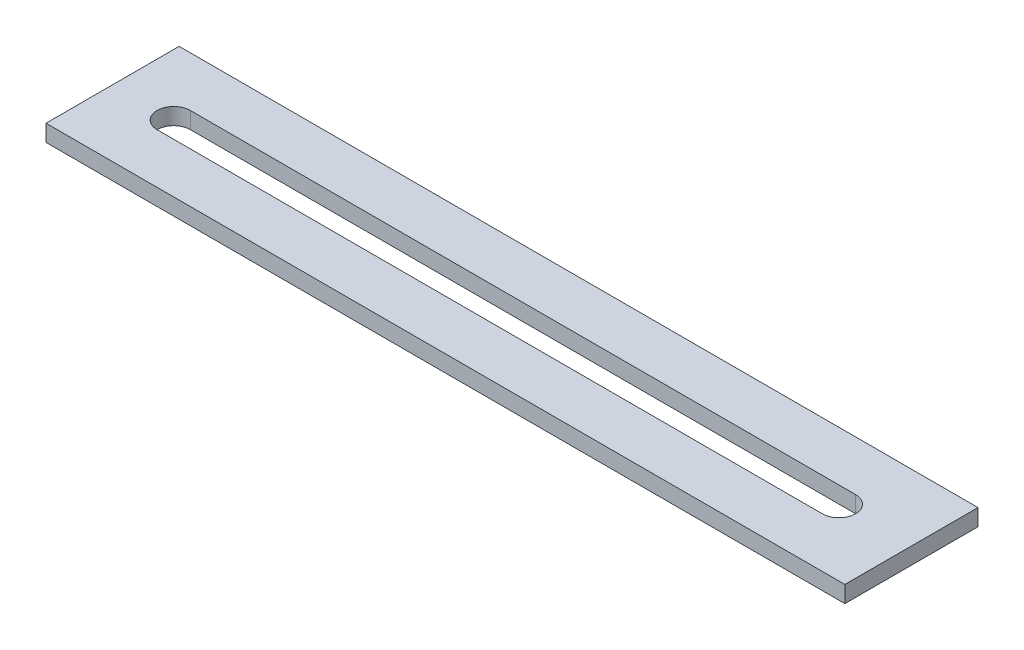
ISO-10303-21;
HEADER;
FILE_DESCRIPTION(('STEP AP214'),'2;1');
FILE_NAME('part.step','',(''),(''),'','','');
FILE_SCHEMA(('AUTOMOTIVE_DESIGN { 1 0 10303 214 1 1 1 1 }'));
ENDSEC;
DATA;
#1=APPLICATION_CONTEXT('core data for automotive mechanical design processes');
#2=APPLICATION_PROTOCOL_DEFINITION('international standard','automotive_design',2000,#1);
#3=PRODUCT_CONTEXT('',#1,'mechanical');
#4=PRODUCT('Part','Part','',(#3));
#5=PRODUCT_RELATED_PRODUCT_CATEGORY('part','',(#4));
#6=PRODUCT_DEFINITION_FORMATION('','',#4);
#7=PRODUCT_DEFINITION_CONTEXT('part definition',#1,'design');
#8=PRODUCT_DEFINITION('design','',#6,#7);
#9=PRODUCT_DEFINITION_SHAPE('','',#8);
#10=(LENGTH_UNIT() NAMED_UNIT(*) SI_UNIT(.MILLI.,.METRE.));
#11=(NAMED_UNIT(*) PLANE_ANGLE_UNIT() SI_UNIT($,.RADIAN.));
#12=(NAMED_UNIT(*) SI_UNIT($,.STERADIAN.) SOLID_ANGLE_UNIT());
#13=UNCERTAINTY_MEASURE_WITH_UNIT(LENGTH_MEASURE(1.E-05),#10,'distance_accuracy_value','');
#14=(GEOMETRIC_REPRESENTATION_CONTEXT(3) GLOBAL_UNCERTAINTY_ASSIGNED_CONTEXT((#13)) GLOBAL_UNIT_ASSIGNED_CONTEXT((#10,
#11,#12)) REPRESENTATION_CONTEXT('',''));
#15=CARTESIAN_POINT('',(0.,0.,0.));
#16=DIRECTION('',(0.,0.,1.));
#17=DIRECTION('',(1.,0.,0.));
#18=AXIS2_PLACEMENT_3D('',#15,#16,#17);
#19=CARTESIAN_POINT('',(0.,3.175,0.));
#20=DIRECTION('',(0.,-1.,0.));
#21=DIRECTION('',(0.,0.,-1.));
#22=AXIS2_PLACEMENT_3D('',#19,#20,#21);
#23=PLANE('',#22);
#24=DIRECTION('',(0.,0.,1.));
#25=VECTOR('',#24,1.);
#26=CARTESIAN_POINT('',(0.,3.175,0.));
#27=LINE('',#26,#25);
#28=CARTESIAN_POINT('',(0.,3.175,-25.4));
#29=VERTEX_POINT('',#28);
#30=CARTESIAN_POINT('',(0.,3.175,0.));
#31=VERTEX_POINT('',#30);
#32=EDGE_CURVE('E134',#29,#31,#27,.T.);
#33=ORIENTED_EDGE('',*,*,#32,.T.);
#34=DIRECTION('',(1.,0.,0.));
#35=VECTOR('',#34,1.);
#36=CARTESIAN_POINT('',(0.,3.175,0.));
#37=LINE('',#36,#35);
#38=CARTESIAN_POINT('',(152.4,3.175,0.));
#39=VERTEX_POINT('',#38);
#40=EDGE_CURVE('E137',#31,#39,#37,.T.);
#41=ORIENTED_EDGE('',*,*,#40,.T.);
#42=DIRECTION('',(0.,0.,-1.));
#43=VECTOR('',#42,1.);
#44=CARTESIAN_POINT('',(152.4,3.175,0.));
#45=LINE('',#44,#43);
#46=CARTESIAN_POINT('',(152.4,3.175,-25.4));
#47=VERTEX_POINT('',#46);
#48=EDGE_CURVE('E140',#39,#47,#45,.T.);
#49=ORIENTED_EDGE('',*,*,#48,.T.);
#50=DIRECTION('',(-1.,0.,0.));
#51=VECTOR('',#50,1.);
#52=CARTESIAN_POINT('',(0.,3.175,-25.4));
#53=LINE('',#52,#51);
#54=EDGE_CURVE('E142',#47,#29,#53,.T.);
#55=ORIENTED_EDGE('',*,*,#54,.T.);
#56=EDGE_LOOP('',(#33,#41,#49,#55));
#57=FACE_BOUND('',#56,.T.);
#58=CARTESIAN_POINT('',(11.6633160622096,3.175,-12.7));
#59=DIRECTION('',(0.,1.,0.));
#60=DIRECTION('',(0.,0.,1.));
#61=AXIS2_PLACEMENT_3D('',#58,#59,#60);
#62=CIRCLE('',#61,3.175);
#63=CARTESIAN_POINT('',(11.6633160622096,3.175,-15.875));
#64=VERTEX_POINT('',#63);
#65=CARTESIAN_POINT('',(11.6633160622096,3.175,-9.525));
#66=VERTEX_POINT('',#65);
#67=EDGE_CURVE('E98',#64,#66,#62,.T.);
#68=ORIENTED_EDGE('',*,*,#67,.F.);
#69=DIRECTION('',(-1.,0.,0.));
#70=VECTOR('',#69,1.);
#71=CARTESIAN_POINT('',(11.6633160622096,3.175,-15.875));
#72=LINE('',#71,#70);
#73=CARTESIAN_POINT('',(138.576758833543,3.175,-15.875));
#74=VERTEX_POINT('',#73);
#75=EDGE_CURVE('E120',#74,#64,#72,.T.);
#76=ORIENTED_EDGE('',*,*,#75,.F.);
#77=CARTESIAN_POINT('',(138.576758833543,3.175,-12.7));
#78=DIRECTION('',(0.,1.,0.));
#79=DIRECTION('',(0.,0.,1.));
#80=AXIS2_PLACEMENT_3D('',#77,#78,#79);
#81=CIRCLE('',#80,3.175);
#82=CARTESIAN_POINT('',(138.576758833543,3.175,-9.525));
#83=VERTEX_POINT('',#82);
#84=EDGE_CURVE('E118',#83,#74,#81,.T.);
#85=ORIENTED_EDGE('',*,*,#84,.F.);
#86=DIRECTION('',(1.,0.,0.));
#87=VECTOR('',#86,1.);
#88=CARTESIAN_POINT('',(11.6633160622096,3.175,-9.525));
#89=LINE('',#88,#87);
#90=EDGE_CURVE('E106',#66,#83,#89,.T.);
#91=ORIENTED_EDGE('',*,*,#90,.F.);
#92=EDGE_LOOP('',(#68,#76,#85,#91));
#93=FACE_BOUND('',#92,.T.);
#94=ADVANCED_FACE('F33',(#57,#93),#23,.F.);
#95=CARTESIAN_POINT('',(0.,0.,0.));
#96=DIRECTION('',(0.,-1.,0.));
#97=DIRECTION('',(0.,0.,-1.));
#98=AXIS2_PLACEMENT_3D('',#95,#96,#97);
#99=PLANE('',#98);
#100=DIRECTION('',(0.,0.,1.));
#101=VECTOR('',#100,1.);
#102=CARTESIAN_POINT('',(0.,0.,0.));
#103=LINE('',#102,#101);
#104=CARTESIAN_POINT('',(0.,0.,-25.4));
#105=VERTEX_POINT('',#104);
#106=CARTESIAN_POINT('',(0.,0.,0.));
#107=VERTEX_POINT('',#106);
#108=EDGE_CURVE('E114',#105,#107,#103,.T.);
#109=ORIENTED_EDGE('',*,*,#108,.F.);
#110=DIRECTION('',(-1.,0.,0.));
#111=VECTOR('',#110,1.);
#112=CARTESIAN_POINT('',(0.,0.,-25.4));
#113=LINE('',#112,#111);
#114=CARTESIAN_POINT('',(152.4,0.,-25.4));
#115=VERTEX_POINT('',#114);
#116=EDGE_CURVE('E138',#115,#105,#113,.T.);
#117=ORIENTED_EDGE('',*,*,#116,.F.);
#118=DIRECTION('',(0.,0.,-1.));
#119=VECTOR('',#118,1.);
#120=CARTESIAN_POINT('',(152.4,0.,0.));
#121=LINE('',#120,#119);
#122=CARTESIAN_POINT('',(152.4,0.,0.));
#123=VERTEX_POINT('',#122);
#124=EDGE_CURVE('E149',#123,#115,#121,.T.);
#125=ORIENTED_EDGE('',*,*,#124,.F.);
#126=DIRECTION('',(1.,0.,0.));
#127=VECTOR('',#126,1.);
#128=CARTESIAN_POINT('',(0.,0.,0.));
#129=LINE('',#128,#127);
#130=EDGE_CURVE('E147',#107,#123,#129,.T.);
#131=ORIENTED_EDGE('',*,*,#130,.F.);
#132=EDGE_LOOP('',(#109,#117,#125,#131));
#133=FACE_BOUND('',#132,.T.);
#134=DIRECTION('',(-1.,0.,0.));
#135=VECTOR('',#134,1.);
#136=CARTESIAN_POINT('',(11.6633160622096,0.,-15.875));
#137=LINE('',#136,#135);
#138=CARTESIAN_POINT('',(138.576758833543,0.,-15.875));
#139=VERTEX_POINT('',#138);
#140=CARTESIAN_POINT('',(11.6633160622096,0.,-15.875));
#141=VERTEX_POINT('',#140);
#142=EDGE_CURVE('E107',#139,#141,#137,.T.);
#143=ORIENTED_EDGE('',*,*,#142,.T.);
#144=CARTESIAN_POINT('',(11.6633160622096,0.,-12.7));
#145=DIRECTION('',(0.,1.,0.));
#146=DIRECTION('',(0.,0.,1.));
#147=AXIS2_PLACEMENT_3D('',#144,#145,#146);
#148=CIRCLE('',#147,3.175);
#149=CARTESIAN_POINT('',(11.6633160622096,0.,-9.525));
#150=VERTEX_POINT('',#149);
#151=EDGE_CURVE('E56',#141,#150,#148,.T.);
#152=ORIENTED_EDGE('',*,*,#151,.T.);
#153=DIRECTION('',(1.,0.,0.));
#154=VECTOR('',#153,1.);
#155=CARTESIAN_POINT('',(11.6633160622096,0.,-9.525));
#156=LINE('',#155,#154);
#157=CARTESIAN_POINT('',(138.576758833543,0.,-9.525));
#158=VERTEX_POINT('',#157);
#159=EDGE_CURVE('E113',#150,#158,#156,.T.);
#160=ORIENTED_EDGE('',*,*,#159,.T.);
#161=CARTESIAN_POINT('',(138.576758833543,0.,-12.7));
#162=DIRECTION('',(0.,1.,0.));
#163=DIRECTION('',(0.,0.,1.));
#164=AXIS2_PLACEMENT_3D('',#161,#162,#163);
#165=CIRCLE('',#164,3.175);
#166=EDGE_CURVE('E126',#158,#139,#165,.T.);
#167=ORIENTED_EDGE('',*,*,#166,.T.);
#168=EDGE_LOOP('',(#143,#152,#160,#167));
#169=FACE_BOUND('',#168,.T.);
#170=ADVANCED_FACE('F167',(#133,#169),#99,.T.);
#171=CARTESIAN_POINT('',(0.,3.175,0.));
#172=DIRECTION('',(1.,0.,0.));
#173=DIRECTION('',(0.,0.,-1.));
#174=AXIS2_PLACEMENT_3D('',#171,#172,#173);
#175=PLANE('',#174);
#176=ORIENTED_EDGE('',*,*,#108,.T.);
#177=DIRECTION('',(0.,-1.,0.));
#178=VECTOR('',#177,1.);
#179=CARTESIAN_POINT('',(0.,3.175,0.));
#180=LINE('',#179,#178);
#181=EDGE_CURVE('E11',#31,#107,#180,.T.);
#182=ORIENTED_EDGE('',*,*,#181,.F.);
#183=ORIENTED_EDGE('',*,*,#32,.F.);
#184=DIRECTION('',(0.,-1.,0.));
#185=VECTOR('',#184,1.);
#186=CARTESIAN_POINT('',(0.,3.175,-25.4));
#187=LINE('',#186,#185);
#188=EDGE_CURVE('E144',#29,#105,#187,.T.);
#189=ORIENTED_EDGE('',*,*,#188,.T.);
#190=EDGE_LOOP('',(#176,#182,#183,#189));
#191=FACE_BOUND('',#190,.T.);
#192=ADVANCED_FACE('F35',(#191),#175,.F.);
#193=CARTESIAN_POINT('',(0.,3.175,0.));
#194=DIRECTION('',(0.,0.,-1.));
#195=DIRECTION('',(-1.,0.,0.));
#196=AXIS2_PLACEMENT_3D('',#193,#194,#195);
#197=PLANE('',#196);
#198=ORIENTED_EDGE('',*,*,#130,.T.);
#199=DIRECTION('',(0.,-1.,0.));
#200=VECTOR('',#199,1.);
#201=CARTESIAN_POINT('',(152.4,3.175,0.));
#202=LINE('',#201,#200);
#203=EDGE_CURVE('E41',#39,#123,#202,.T.);
#204=ORIENTED_EDGE('',*,*,#203,.F.);
#205=ORIENTED_EDGE('',*,*,#40,.F.);
#206=ORIENTED_EDGE('',*,*,#181,.T.);
#207=EDGE_LOOP('',(#198,#204,#205,#206));
#208=FACE_BOUND('',#207,.T.);
#209=ADVANCED_FACE('F177',(#208),#197,.F.);
#210=CARTESIAN_POINT('',(152.4,3.175,0.));
#211=DIRECTION('',(-1.,0.,0.));
#212=DIRECTION('',(0.,0.,1.));
#213=AXIS2_PLACEMENT_3D('',#210,#211,#212);
#214=PLANE('',#213);
#215=ORIENTED_EDGE('',*,*,#124,.T.);
#216=DIRECTION('',(0.,-1.,0.));
#217=VECTOR('',#216,1.);
#218=CARTESIAN_POINT('',(152.4,3.175,-25.4));
#219=LINE('',#218,#217);
#220=EDGE_CURVE('E154',#47,#115,#219,.T.);
#221=ORIENTED_EDGE('',*,*,#220,.F.);
#222=ORIENTED_EDGE('',*,*,#48,.F.);
#223=ORIENTED_EDGE('',*,*,#203,.T.);
#224=EDGE_LOOP('',(#215,#221,#222,#223));
#225=FACE_BOUND('',#224,.T.);
#226=ADVANCED_FACE('F161',(#225),#214,.F.);
#227=CARTESIAN_POINT('',(0.,3.175,-25.4));
#228=DIRECTION('',(0.,0.,1.));
#229=DIRECTION('',(1.,0.,0.));
#230=AXIS2_PLACEMENT_3D('',#227,#228,#229);
#231=PLANE('',#230);
#232=ORIENTED_EDGE('',*,*,#116,.T.);
#233=ORIENTED_EDGE('',*,*,#188,.F.);
#234=ORIENTED_EDGE('',*,*,#54,.F.);
#235=ORIENTED_EDGE('',*,*,#220,.T.);
#236=EDGE_LOOP('',(#232,#233,#234,#235));
#237=FACE_BOUND('',#236,.T.);
#238=ADVANCED_FACE('F171',(#237),#231,.F.);
#239=CARTESIAN_POINT('',(11.6633160622096,3.175,-12.7));
#240=DIRECTION('',(0.,-1.,0.));
#241=DIRECTION('',(0.,0.,-1.));
#242=AXIS2_PLACEMENT_3D('',#239,#240,#241);
#243=CYLINDRICAL_SURFACE('',#242,3.175);
#244=ORIENTED_EDGE('',*,*,#151,.F.);
#245=DIRECTION('',(0.,-1.,0.));
#246=VECTOR('',#245,1.);
#247=CARTESIAN_POINT('',(11.6633160622096,3.175,-15.875));
#248=LINE('',#247,#246);
#249=EDGE_CURVE('E102',#64,#141,#248,.T.);
#250=ORIENTED_EDGE('',*,*,#249,.F.);
#251=ORIENTED_EDGE('',*,*,#67,.T.);
#252=DIRECTION('',(0.,-1.,0.));
#253=VECTOR('',#252,1.);
#254=CARTESIAN_POINT('',(11.6633160622096,3.175,-9.525));
#255=LINE('',#254,#253);
#256=EDGE_CURVE('E101',#66,#150,#255,.T.);
#257=ORIENTED_EDGE('',*,*,#256,.T.);
#258=EDGE_LOOP('',(#244,#250,#251,#257));
#259=FACE_BOUND('',#258,.T.);
#260=ADVANCED_FACE('F100',(#259),#243,.F.);
#261=CARTESIAN_POINT('',(11.6633160622096,3.175,-9.525));
#262=DIRECTION('',(0.,0.,-1.));
#263=DIRECTION('',(-1.,0.,0.));
#264=AXIS2_PLACEMENT_3D('',#261,#262,#263);
#265=PLANE('',#264);
#266=ORIENTED_EDGE('',*,*,#159,.F.);
#267=ORIENTED_EDGE('',*,*,#256,.F.);
#268=ORIENTED_EDGE('',*,*,#90,.T.);
#269=DIRECTION('',(0.,-1.,0.));
#270=VECTOR('',#269,1.);
#271=CARTESIAN_POINT('',(138.576758833543,3.175,-9.525));
#272=LINE('',#271,#270);
#273=EDGE_CURVE('E115',#83,#158,#272,.T.);
#274=ORIENTED_EDGE('',*,*,#273,.T.);
#275=EDGE_LOOP('',(#266,#267,#268,#274));
#276=FACE_BOUND('',#275,.T.);
#277=ADVANCED_FACE('F110',(#276),#265,.T.);
#278=CARTESIAN_POINT('',(138.576758833543,3.175,-12.7));
#279=DIRECTION('',(0.,-1.,0.));
#280=DIRECTION('',(0.,0.,-1.));
#281=AXIS2_PLACEMENT_3D('',#278,#279,#280);
#282=CYLINDRICAL_SURFACE('',#281,3.175);
#283=ORIENTED_EDGE('',*,*,#166,.F.);
#284=ORIENTED_EDGE('',*,*,#273,.F.);
#285=ORIENTED_EDGE('',*,*,#84,.T.);
#286=DIRECTION('',(0.,-1.,0.));
#287=VECTOR('',#286,1.);
#288=CARTESIAN_POINT('',(138.576758833543,3.175,-15.875));
#289=LINE('',#288,#287);
#290=EDGE_CURVE('E48',#74,#139,#289,.T.);
#291=ORIENTED_EDGE('',*,*,#290,.T.);
#292=EDGE_LOOP('',(#283,#284,#285,#291));
#293=FACE_BOUND('',#292,.T.);
#294=ADVANCED_FACE('F200',(#293),#282,.F.);
#295=CARTESIAN_POINT('',(11.6633160622096,3.175,-15.875));
#296=DIRECTION('',(0.,0.,1.));
#297=DIRECTION('',(1.,0.,0.));
#298=AXIS2_PLACEMENT_3D('',#295,#296,#297);
#299=PLANE('',#298);
#300=ORIENTED_EDGE('',*,*,#142,.F.);
#301=ORIENTED_EDGE('',*,*,#290,.F.);
#302=ORIENTED_EDGE('',*,*,#75,.T.);
#303=ORIENTED_EDGE('',*,*,#249,.T.);
#304=EDGE_LOOP('',(#300,#301,#302,#303));
#305=FACE_BOUND('',#304,.T.);
#306=ADVANCED_FACE('F204',(#305),#299,.T.);
#307=CLOSED_SHELL('',(#94,#170,#192,#209,#226,#238,#260,#277,#294,#306));
#308=MANIFOLD_SOLID_BREP('B2',#307);
#309=ADVANCED_BREP_SHAPE_REPRESENTATION('',(#18,#308),#14);
#310=SHAPE_DEFINITION_REPRESENTATION(#9,#309);
ENDSEC;
END-ISO-10303-21;
